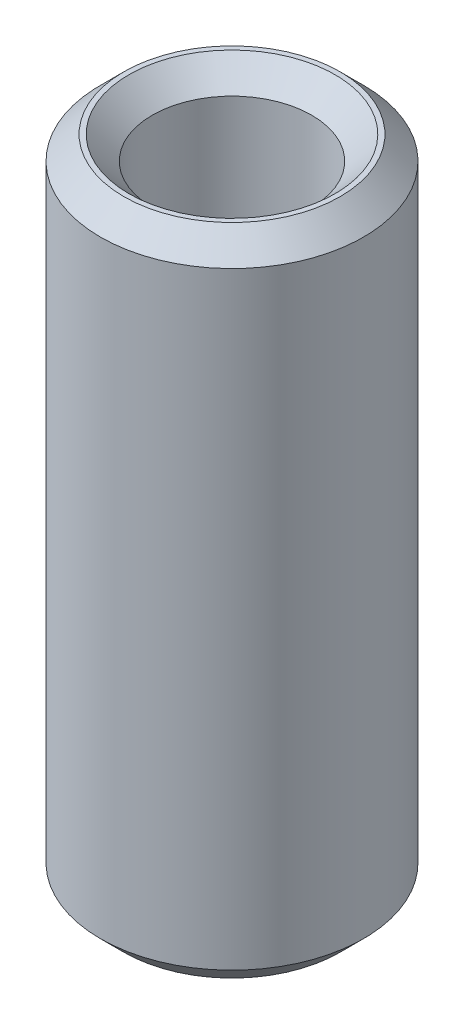
ISO-10303-21;
HEADER;
FILE_DESCRIPTION(('STEP AP214'),'2;1');
FILE_NAME('part.step','',(''),(''),'','','');
FILE_SCHEMA(('AUTOMOTIVE_DESIGN { 1 0 10303 214 1 1 1 1 }'));
ENDSEC;
DATA;
#1=APPLICATION_CONTEXT('core data for automotive mechanical design processes');
#2=APPLICATION_PROTOCOL_DEFINITION('international standard','automotive_design',2000,#1);
#3=PRODUCT_CONTEXT('',#1,'mechanical');
#4=PRODUCT('Part','Part','',(#3));
#5=PRODUCT_RELATED_PRODUCT_CATEGORY('part','',(#4));
#6=PRODUCT_DEFINITION_FORMATION('','',#4);
#7=PRODUCT_DEFINITION_CONTEXT('part definition',#1,'design');
#8=PRODUCT_DEFINITION('design','',#6,#7);
#9=PRODUCT_DEFINITION_SHAPE('','',#8);
#10=(LENGTH_UNIT() NAMED_UNIT(*) SI_UNIT(.MILLI.,.METRE.));
#11=(NAMED_UNIT(*) PLANE_ANGLE_UNIT() SI_UNIT($,.RADIAN.));
#12=(NAMED_UNIT(*) SI_UNIT($,.STERADIAN.) SOLID_ANGLE_UNIT());
#13=UNCERTAINTY_MEASURE_WITH_UNIT(LENGTH_MEASURE(1.E-05),#10,'distance_accuracy_value','');
#14=(GEOMETRIC_REPRESENTATION_CONTEXT(3) GLOBAL_UNCERTAINTY_ASSIGNED_CONTEXT((#13)) GLOBAL_UNIT_ASSIGNED_CONTEXT((#10,
#11,#12)) REPRESENTATION_CONTEXT('',''));
#15=CARTESIAN_POINT('',(0.,0.,0.));
#16=DIRECTION('',(0.,0.,1.));
#17=DIRECTION('',(1.,0.,0.));
#18=AXIS2_PLACEMENT_3D('',#15,#16,#17);
#19=CARTESIAN_POINT('',(0.,49.7491488981475,0.));
#20=DIRECTION('',(0.,-1.,0.));
#21=DIRECTION('',(0.,0.,-1.));
#22=AXIS2_PLACEMENT_3D('',#19,#20,#21);
#23=CYLINDRICAL_SURFACE('',#22,10.);
#24=CARTESIAN_POINT('',(0.,1.77669526970722,0.));
#25=DIRECTION('',(0.,1.,0.));
#26=DIRECTION('',(0.,0.,1.));
#27=AXIS2_PLACEMENT_3D('',#24,#25,#26);
#28=CIRCLE('',#27,10.);
#29=CARTESIAN_POINT('',(0.,1.77669526970722,10.));
#30=VERTEX_POINT('',#29);
#31=EDGE_CURVE('E10',#30,#30,#28,.T.);
#32=ORIENTED_EDGE('',*,*,#31,.T.);
#33=EDGE_LOOP('',(#32));
#34=FACE_BOUND('',#33,.T.);
#35=CARTESIAN_POINT('',(0.,47.9724536284402,0.));
#36=DIRECTION('',(0.,1.,0.));
#37=DIRECTION('',(0.,0.,1.));
#38=AXIS2_PLACEMENT_3D('',#35,#36,#37);
#39=CIRCLE('',#38,10.);
#40=CARTESIAN_POINT('',(0.,47.9724536284402,10.));
#41=VERTEX_POINT('',#40);
#42=EDGE_CURVE('E50',#41,#41,#39,.F.);
#43=ORIENTED_EDGE('',*,*,#42,.T.);
#44=EDGE_LOOP('',(#43));
#45=FACE_BOUND('',#44,.T.);
#46=ADVANCED_FACE('F39',(#34,#45),#23,.T.);
#47=CARTESIAN_POINT('',(0.,49.7491488981475,0.));
#48=DIRECTION('',(0.,1.,0.));
#49=DIRECTION('',(0.,0.,1.));
#50=AXIS2_PLACEMENT_3D('',#47,#48,#49);
#51=PLANE('',#50);
#52=CARTESIAN_POINT('',(0.,49.7491488981475,0.));
#53=DIRECTION('',(0.,1.,0.));
#54=DIRECTION('',(0.,0.,1.));
#55=AXIS2_PLACEMENT_3D('',#52,#53,#54);
#56=CIRCLE('',#55,7.83859890163104);
#57=CARTESIAN_POINT('',(0.,49.7491488981475,7.83859890163104));
#58=VERTEX_POINT('',#57);
#59=EDGE_CURVE('E58',#58,#58,#56,.F.);
#60=ORIENTED_EDGE('',*,*,#59,.T.);
#61=EDGE_LOOP('',(#60));
#62=FACE_BOUND('',#61,.T.);
#63=CARTESIAN_POINT('',(0.,49.7491488981475,0.));
#64=DIRECTION('',(0.,1.,0.));
#65=DIRECTION('',(0.,0.,1.));
#66=AXIS2_PLACEMENT_3D('',#63,#64,#65);
#67=CIRCLE('',#66,8.22330473029277);
#68=CARTESIAN_POINT('',(0.,49.7491488981475,8.22330473029277));
#69=VERTEX_POINT('',#68);
#70=EDGE_CURVE('E61',#69,#69,#67,.T.);
#71=ORIENTED_EDGE('',*,*,#70,.T.);
#72=EDGE_LOOP('',(#71));
#73=FACE_BOUND('',#72,.T.);
#74=ADVANCED_FACE('F88',(#62,#73),#51,.T.);
#75=CARTESIAN_POINT('',(0.,0.,0.));
#76=DIRECTION('',(0.,1.,0.));
#77=DIRECTION('',(0.,0.,1.));
#78=AXIS2_PLACEMENT_3D('',#75,#76,#77);
#79=PLANE('',#78);
#80=CARTESIAN_POINT('',(0.,0.,0.));
#81=DIRECTION('',(0.,1.,0.));
#82=DIRECTION('',(0.,0.,1.));
#83=AXIS2_PLACEMENT_3D('',#80,#81,#82);
#84=CIRCLE('',#83,7.83859890163102);
#85=CARTESIAN_POINT('',(0.,0.,-7.83859890163102));
#86=VERTEX_POINT('',#85);
#87=EDGE_CURVE('E51',#86,#86,#84,.T.);
#88=ORIENTED_EDGE('',*,*,#87,.T.);
#89=EDGE_LOOP('',(#88));
#90=FACE_BOUND('',#89,.T.);
#91=CARTESIAN_POINT('',(0.,0.,0.));
#92=DIRECTION('',(0.,1.,0.));
#93=DIRECTION('',(0.,0.,1.));
#94=AXIS2_PLACEMENT_3D('',#91,#92,#93);
#95=CIRCLE('',#94,8.22330473029276);
#96=CARTESIAN_POINT('',(0.,0.,8.22330473029276));
#97=VERTEX_POINT('',#96);
#98=EDGE_CURVE('E54',#97,#97,#95,.F.);
#99=ORIENTED_EDGE('',*,*,#98,.T.);
#100=EDGE_LOOP('',(#99));
#101=FACE_BOUND('',#100,.T.);
#102=ADVANCED_FACE('F83',(#90,#101),#79,.F.);
#103=CARTESIAN_POINT('',(0.,49.7491488981475,0.));
#104=DIRECTION('',(0.,-1.,0.));
#105=DIRECTION('',(0.,0.,-1.));
#106=AXIS2_PLACEMENT_3D('',#103,#104,#105);
#107=CYLINDRICAL_SURFACE('',#106,6.0619036319238);
#108=CARTESIAN_POINT('',(0.,47.9724536284402,0.));
#109=DIRECTION('',(0.,1.,0.));
#110=DIRECTION('',(0.,0.,1.));
#111=AXIS2_PLACEMENT_3D('',#108,#109,#110);
#112=CIRCLE('',#111,6.0619036319238);
#113=CARTESIAN_POINT('',(0.,47.9724536284402,6.0619036319238));
#114=VERTEX_POINT('',#113);
#115=EDGE_CURVE('E67',#114,#114,#112,.T.);
#116=ORIENTED_EDGE('',*,*,#115,.T.);
#117=EDGE_LOOP('',(#116));
#118=FACE_BOUND('',#117,.T.);
#119=CARTESIAN_POINT('',(0.,1.77669526970723,0.));
#120=DIRECTION('',(0.,1.,0.));
#121=DIRECTION('',(0.,0.,1.));
#122=AXIS2_PLACEMENT_3D('',#119,#120,#121);
#123=CIRCLE('',#122,6.0619036319238);
#124=CARTESIAN_POINT('',(0.,1.77669526970723,-6.0619036319238));
#125=VERTEX_POINT('',#124);
#126=EDGE_CURVE('E69',#125,#125,#123,.F.);
#127=ORIENTED_EDGE('',*,*,#126,.T.);
#128=EDGE_LOOP('',(#127));
#129=FACE_BOUND('',#128,.T.);
#130=ADVANCED_FACE('F71',(#118,#129),#107,.F.);
#131=CARTESIAN_POINT('',(0.,47.9724536284402,0.));
#132=DIRECTION('',(0.,1.,0.));
#133=DIRECTION('',(0.,0.,1.));
#134=AXIS2_PLACEMENT_3D('',#131,#132,#133);
#135=CONICAL_SURFACE('',#134,6.0619036319238,0.785398163397452);
#136=ORIENTED_EDGE('',*,*,#59,.F.);
#137=EDGE_LOOP('',(#136));
#138=FACE_BOUND('',#137,.T.);
#139=ORIENTED_EDGE('',*,*,#115,.F.);
#140=EDGE_LOOP('',(#139));
#141=FACE_BOUND('',#140,.T.);
#142=ADVANCED_FACE('F77',(#138,#141),#135,.F.);
#143=CARTESIAN_POINT('',(0.,0.,0.));
#144=DIRECTION('',(0.,-1.,0.));
#145=DIRECTION('',(0.,0.,-1.));
#146=AXIS2_PLACEMENT_3D('',#143,#144,#145);
#147=CONICAL_SURFACE('',#146,7.83859890163102,0.785398163397444);
#148=CARTESIAN_POINT('',(0.,1.77669526970723,-6.0619036319238));
#149=CARTESIAN_POINT('',(0.,1.75818802731445,-6.08041087431658));
#150=CARTESIAN_POINT('',(0.,1.73968078492166,-6.09891811670937));
#151=CARTESIAN_POINT('',(0.,1.7026663001361,-6.13593260149493));
#152=CARTESIAN_POINT('',(0.,1.68415905774331,-6.15443984388772));
#153=CARTESIAN_POINT('',(0.,1.64714457295774,-6.19145432867328));
#154=CARTESIAN_POINT('',(0.,1.62863733056496,-6.20996157106607));
#155=CARTESIAN_POINT('',(0.,1.59162284577939,-6.24697605585163));
#156=CARTESIAN_POINT('',(0.,1.57311560338661,-6.26548329824442));
#157=CARTESIAN_POINT('',(0.,1.53610111860104,-6.30249778302998));
#158=CARTESIAN_POINT('',(0.,1.51759387620826,-6.32100502542277));
#159=CARTESIAN_POINT('',(0.,1.48057939142269,-6.35801951020833));
#160=CARTESIAN_POINT('',(0.,1.46207214902991,-6.37652675260112));
#161=CARTESIAN_POINT('',(0.,1.42505766424434,-6.41354123738668));
#162=CARTESIAN_POINT('',(0.,1.40655042185156,-6.43204847977947));
#163=CARTESIAN_POINT('',(0.,1.36953593706599,-6.46906296456504));
#164=CARTESIAN_POINT('',(0.,1.35102869467321,-6.48757020695782));
#165=CARTESIAN_POINT('',(0.,1.31401420988764,-6.52458469174339));
#166=CARTESIAN_POINT('',(0.,1.29550696749486,-6.54309193413617));
#167=CARTESIAN_POINT('',(0.,1.25849248270929,-6.58010641892174));
#168=CARTESIAN_POINT('',(0.,1.2399852403165,-6.59861366131452));
#169=CARTESIAN_POINT('',(0.,1.20297075553094,-6.63562814610009));
#170=CARTESIAN_POINT('',(0.,1.18446351313815,-6.65413538849287));
#171=CARTESIAN_POINT('',(0.,1.14744902835259,-6.69114987327844));
#172=CARTESIAN_POINT('',(0.,1.1289417859598,-6.70965711567122));
#173=CARTESIAN_POINT('',(0.,1.09192730117424,-6.74667160045679));
#174=CARTESIAN_POINT('',(0.,1.07342005878145,-6.76517884284957));
#175=CARTESIAN_POINT('',(0.,1.03640557399588,-6.80219332763514));
#176=CARTESIAN_POINT('',(0.,1.0178983316031,-6.82070057002792));
#177=CARTESIAN_POINT('',(0.,0.980883846817533,-6.85771505481349));
#178=CARTESIAN_POINT('',(0.,0.96237660442475,-6.87622229720627));
#179=CARTESIAN_POINT('',(0.,0.925362119639182,-6.91323678199184));
#180=CARTESIAN_POINT('',(0.,0.906854877246399,-6.93174402438462));
#181=CARTESIAN_POINT('',(0.,0.869840392460831,-6.96875850917019));
#182=CARTESIAN_POINT('',(0.,0.851333150068048,-6.98726575156297));
#183=CARTESIAN_POINT('',(0.,0.814318665282481,-7.02428023634854));
#184=CARTESIAN_POINT('',(0.,0.795811422889697,-7.04278747874132));
#185=CARTESIAN_POINT('',(0.,0.75879693810413,-7.07980196352689));
#186=CARTESIAN_POINT('',(0.,0.740289695711346,-7.09830920591968));
#187=CARTESIAN_POINT('',(0.,0.703275210925778,-7.13532369070524));
#188=CARTESIAN_POINT('',(0.,0.684767968532995,-7.15383093309802));
#189=CARTESIAN_POINT('',(0.,0.647753483747428,-7.19084541788359));
#190=CARTESIAN_POINT('',(0.,0.629246241354644,-7.20935266027638));
#191=CARTESIAN_POINT('',(0.,0.592231756569077,-7.24636714506194));
#192=CARTESIAN_POINT('',(0.,0.573724514176293,-7.26487438745473));
#193=CARTESIAN_POINT('',(0.,0.536710029390726,-7.30188887224029));
#194=CARTESIAN_POINT('',(0.,0.518202786997942,-7.32039611463308));
#195=CARTESIAN_POINT('',(0.,0.481188302212375,-7.35741059941864));
#196=CARTESIAN_POINT('',(0.,0.462681059819591,-7.37591784181143));
#197=CARTESIAN_POINT('',(0.,0.425666575034024,-7.41293232659699));
#198=CARTESIAN_POINT('',(0.,0.40715933264124,-7.43143956898978));
#199=CARTESIAN_POINT('',(0.,0.370144847855673,-7.46845405377535));
#200=CARTESIAN_POINT('',(0.,0.351637605462889,-7.48696129616813));
#201=CARTESIAN_POINT('',(0.,0.314623120677322,-7.5239757809537));
#202=CARTESIAN_POINT('',(0.,0.296115878284538,-7.54248302334648));
#203=CARTESIAN_POINT('',(0.,0.259101393498971,-7.57949750813205));
#204=CARTESIAN_POINT('',(0.,0.240594151106187,-7.59800475052483));
#205=CARTESIAN_POINT('',(0.,0.20357966632062,-7.6350192353104));
#206=CARTESIAN_POINT('',(0.,0.185072423927836,-7.65352647770318));
#207=CARTESIAN_POINT('',(0.,0.148057939142269,-7.69054096248875));
#208=CARTESIAN_POINT('',(0.,0.129550696749486,-7.70904820488153));
#209=CARTESIAN_POINT('',(0.,0.0925362119639183,-7.7460626896671));
#210=CARTESIAN_POINT('',(0.,0.0740289695711346,-7.76456993205988));
#211=CARTESIAN_POINT('',(0.,0.0370144847855672,-7.80158441684545));
#212=CARTESIAN_POINT('',(0.,0.0185072423927835,-7.82009165923823));
#213=CARTESIAN_POINT('',(0.,0.,-7.83859890163102));
#214=B_SPLINE_CURVE_WITH_KNOTS('',3,(#148,#149,#150,#151,#152,#153,#154,#155,#156,#157,#158,
#159,#160,#161,#162,#163,#164,#165,#166,#167,#168,#169,#170,#171,#172,#173,#174,#175,#176,#177,
#178,#179,#180,#181,#182,#183,#184,#185,#186,#187,#188,#189,#190,#191,#192,#193,#194,#195,#196,
#197,#198,#199,#200,#201,#202,#203,#204,#205,#206,#207,#208,#209,#210,#211,#212,#213),
.UNSPECIFIED.,.F.,.F.,(4,2,2,2,2,2,2,2,2,2,2,2,2,2,2,2,2,2,2,2,2,2,2,2,2,2,2,2,2,2,2,2,4),(0.,
0.0785195795820026,0.157039159164005,0.235558738746007,0.31407831832801,0.392597897910013,
0.471117477492015,0.549637057074017,0.62815663665602,0.706676216238022,0.785195795820025,
0.863715375402027,0.94223495498403,1.02075453456603,1.09927411414803,1.17779369373004,
1.25631327331204,1.33483285289404,1.41335243247604,1.49187201205805,1.57039159164005,
1.64891117122205,1.72743075080405,1.80595033038606,1.88446990996806,1.96298948955006,
2.04150906913206,2.12002864871407,2.19854822829607,2.27706780787807,2.35558738746007,
2.43410696704208,2.51262654662408),.UNSPECIFIED.);
#215=EDGE_CURVE('BSEAM73',#125,#86,#214,.T.);
#216=ORIENTED_EDGE('',*,*,#126,.F.);
#217=ORIENTED_EDGE('',*,*,#87,.F.);
#218=ORIENTED_EDGE('',*,*,#215,.T.);
#219=ORIENTED_EDGE('',*,*,#215,.F.);
#220=EDGE_LOOP('',(#216,#218,#217,#219));
#221=FACE_BOUND('',#220,.T.);
#222=ADVANCED_FACE('F73',(#221),#147,.F.);
#223=CARTESIAN_POINT('',(0.,1.77669526970722,0.));
#224=DIRECTION('',(0.,1.,0.));
#225=DIRECTION('',(0.,0.,1.));
#226=AXIS2_PLACEMENT_3D('',#223,#224,#225);
#227=CONICAL_SURFACE('',#226,10.,0.785398163397452);
#228=ORIENTED_EDGE('',*,*,#98,.F.);
#229=EDGE_LOOP('',(#228));
#230=FACE_BOUND('',#229,.T.);
#231=ORIENTED_EDGE('',*,*,#31,.F.);
#232=EDGE_LOOP('',(#231));
#233=FACE_BOUND('',#232,.T.);
#234=ADVANCED_FACE('F76',(#230,#233),#227,.T.);
#235=CARTESIAN_POINT('',(0.,49.7491488981475,0.));
#236=DIRECTION('',(0.,-1.,0.));
#237=DIRECTION('',(0.,0.,-1.));
#238=AXIS2_PLACEMENT_3D('',#235,#236,#237);
#239=CONICAL_SURFACE('',#238,8.22330473029277,0.785398163397444);
#240=ORIENTED_EDGE('',*,*,#42,.F.);
#241=EDGE_LOOP('',(#240));
#242=FACE_BOUND('',#241,.T.);
#243=ORIENTED_EDGE('',*,*,#70,.F.);
#244=EDGE_LOOP('',(#243));
#245=FACE_BOUND('',#244,.T.);
#246=ADVANCED_FACE('F45',(#242,#245),#239,.T.);
#247=CLOSED_SHELL('',(#46,#74,#102,#130,#142,#222,#234,#246));
#248=MANIFOLD_SOLID_BREP('B2',#247);
#249=ADVANCED_BREP_SHAPE_REPRESENTATION('',(#18,#248),#14);
#250=SHAPE_DEFINITION_REPRESENTATION(#9,#249);
ENDSEC;
END-ISO-10303-21;
